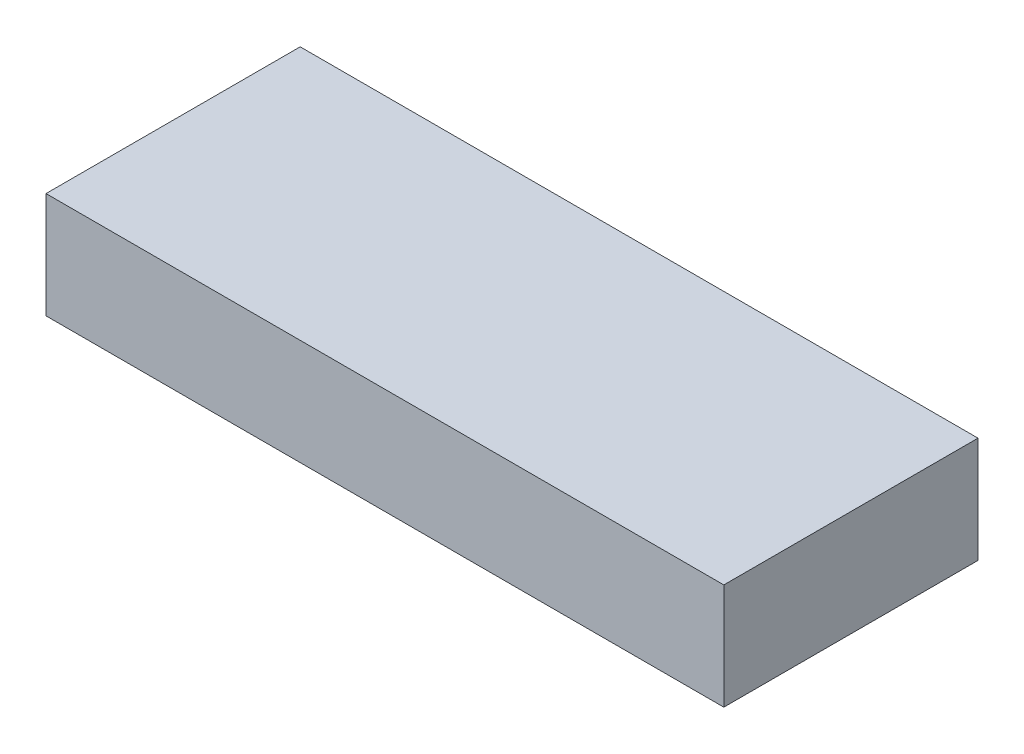
ISO-10303-21;
HEADER;
FILE_DESCRIPTION(('STEP AP214'),'2;1');
FILE_NAME('part.step','',(''),(''),'','','');
FILE_SCHEMA(('AUTOMOTIVE_DESIGN { 1 0 10303 214 1 1 1 1 }'));
ENDSEC;
DATA;
#1=APPLICATION_CONTEXT('core data for automotive mechanical design processes');
#2=APPLICATION_PROTOCOL_DEFINITION('international standard','automotive_design',2000,#1);
#3=PRODUCT_CONTEXT('',#1,'mechanical');
#4=PRODUCT('Part','Part','',(#3));
#5=PRODUCT_RELATED_PRODUCT_CATEGORY('part','',(#4));
#6=PRODUCT_DEFINITION_FORMATION('','',#4);
#7=PRODUCT_DEFINITION_CONTEXT('part definition',#1,'design');
#8=PRODUCT_DEFINITION('design','',#6,#7);
#9=PRODUCT_DEFINITION_SHAPE('','',#8);
#10=(LENGTH_UNIT() NAMED_UNIT(*) SI_UNIT(.MILLI.,.METRE.));
#11=(NAMED_UNIT(*) PLANE_ANGLE_UNIT() SI_UNIT($,.RADIAN.));
#12=(NAMED_UNIT(*) SI_UNIT($,.STERADIAN.) SOLID_ANGLE_UNIT());
#13=UNCERTAINTY_MEASURE_WITH_UNIT(LENGTH_MEASURE(1.E-05),#10,'distance_accuracy_value','');
#14=(GEOMETRIC_REPRESENTATION_CONTEXT(3) GLOBAL_UNCERTAINTY_ASSIGNED_CONTEXT((#13)) GLOBAL_UNIT_ASSIGNED_CONTEXT((#10,
#11,#12)) REPRESENTATION_CONTEXT('',''));
#15=CARTESIAN_POINT('',(0.,0.,0.));
#16=DIRECTION('',(0.,0.,1.));
#17=DIRECTION('',(1.,0.,0.));
#18=AXIS2_PLACEMENT_3D('',#15,#16,#17);
#19=CARTESIAN_POINT('',(0.,-15.,18.));
#20=DIRECTION('',(-1.,0.,0.));
#21=DIRECTION('',(0.,0.,1.));
#22=AXIS2_PLACEMENT_3D('',#19,#20,#21);
#23=PLANE('',#22);
#24=DIRECTION('',(0.,0.,1.));
#25=VECTOR('',#24,1.);
#26=CARTESIAN_POINT('',(0.,0.,18.));
#27=LINE('',#26,#25);
#28=CARTESIAN_POINT('',(0.,0.,-18.));
#29=VERTEX_POINT('',#28);
#30=CARTESIAN_POINT('',(0.,0.,18.));
#31=VERTEX_POINT('',#30);
#32=EDGE_CURVE('E101',#29,#31,#27,.T.);
#33=ORIENTED_EDGE('',*,*,#32,.F.);
#34=DIRECTION('',(0.,1.,0.));
#35=VECTOR('',#34,1.);
#36=CARTESIAN_POINT('',(0.,-15.,-18.));
#37=LINE('',#36,#35);
#38=CARTESIAN_POINT('',(0.,-15.,-18.));
#39=VERTEX_POINT('',#38);
#40=EDGE_CURVE('E11',#39,#29,#37,.T.);
#41=ORIENTED_EDGE('',*,*,#40,.F.);
#42=DIRECTION('',(0.,0.,1.));
#43=VECTOR('',#42,1.);
#44=CARTESIAN_POINT('',(0.,-15.,18.));
#45=LINE('',#44,#43);
#46=CARTESIAN_POINT('',(0.,-15.,18.));
#47=VERTEX_POINT('',#46);
#48=EDGE_CURVE('E95',#39,#47,#45,.T.);
#49=ORIENTED_EDGE('',*,*,#48,.T.);
#50=DIRECTION('',(0.,1.,0.));
#51=VECTOR('',#50,1.);
#52=CARTESIAN_POINT('',(0.,-15.,18.));
#53=LINE('',#52,#51);
#54=EDGE_CURVE('E40',#47,#31,#53,.T.);
#55=ORIENTED_EDGE('',*,*,#54,.T.);
#56=EDGE_LOOP('',(#33,#41,#49,#55));
#57=FACE_BOUND('',#56,.T.);
#58=ADVANCED_FACE('F37',(#57),#23,.T.);
#59=CARTESIAN_POINT('',(0.,-15.,-18.));
#60=DIRECTION('',(0.,0.,-1.));
#61=DIRECTION('',(-1.,0.,0.));
#62=AXIS2_PLACEMENT_3D('',#59,#60,#61);
#63=PLANE('',#62);
#64=DIRECTION('',(-1.,0.,0.));
#65=VECTOR('',#64,1.);
#66=CARTESIAN_POINT('',(0.,0.,-18.));
#67=LINE('',#66,#65);
#68=CARTESIAN_POINT('',(96.,0.,-18.));
#69=VERTEX_POINT('',#68);
#70=EDGE_CURVE('E97',#69,#29,#67,.T.);
#71=ORIENTED_EDGE('',*,*,#70,.F.);
#72=DIRECTION('',(0.,1.,0.));
#73=VECTOR('',#72,1.);
#74=CARTESIAN_POINT('',(96.,-15.,-18.));
#75=LINE('',#74,#73);
#76=CARTESIAN_POINT('',(96.,-15.,-18.));
#77=VERTEX_POINT('',#76);
#78=EDGE_CURVE('E46',#77,#69,#75,.T.);
#79=ORIENTED_EDGE('',*,*,#78,.F.);
#80=DIRECTION('',(-1.,0.,0.));
#81=VECTOR('',#80,1.);
#82=CARTESIAN_POINT('',(0.,-15.,-18.));
#83=LINE('',#82,#81);
#84=EDGE_CURVE('E92',#77,#39,#83,.T.);
#85=ORIENTED_EDGE('',*,*,#84,.T.);
#86=ORIENTED_EDGE('',*,*,#40,.T.);
#87=EDGE_LOOP('',(#71,#79,#85,#86));
#88=FACE_BOUND('',#87,.T.);
#89=ADVANCED_FACE('F111',(#88),#63,.T.);
#90=CARTESIAN_POINT('',(96.,-15.,18.));
#91=DIRECTION('',(1.,0.,0.));
#92=DIRECTION('',(0.,0.,-1.));
#93=AXIS2_PLACEMENT_3D('',#90,#91,#92);
#94=PLANE('',#93);
#95=DIRECTION('',(0.,0.,-1.));
#96=VECTOR('',#95,1.);
#97=CARTESIAN_POINT('',(96.,0.,18.));
#98=LINE('',#97,#96);
#99=CARTESIAN_POINT('',(96.,0.,18.));
#100=VERTEX_POINT('',#99);
#101=EDGE_CURVE('E87',#100,#69,#98,.T.);
#102=ORIENTED_EDGE('',*,*,#101,.F.);
#103=DIRECTION('',(0.,1.,0.));
#104=VECTOR('',#103,1.);
#105=CARTESIAN_POINT('',(96.,-15.,18.));
#106=LINE('',#105,#104);
#107=CARTESIAN_POINT('',(96.,-15.,18.));
#108=VERTEX_POINT('',#107);
#109=EDGE_CURVE('E82',#108,#100,#106,.T.);
#110=ORIENTED_EDGE('',*,*,#109,.F.);
#111=DIRECTION('',(0.,0.,-1.));
#112=VECTOR('',#111,1.);
#113=CARTESIAN_POINT('',(96.,-15.,18.));
#114=LINE('',#113,#112);
#115=EDGE_CURVE('E85',#108,#77,#114,.T.);
#116=ORIENTED_EDGE('',*,*,#115,.T.);
#117=ORIENTED_EDGE('',*,*,#78,.T.);
#118=EDGE_LOOP('',(#102,#110,#116,#117));
#119=FACE_BOUND('',#118,.T.);
#120=ADVANCED_FACE('F84',(#119),#94,.T.);
#121=CARTESIAN_POINT('',(0.,-15.,18.));
#122=DIRECTION('',(0.,0.,1.));
#123=DIRECTION('',(1.,0.,0.));
#124=AXIS2_PLACEMENT_3D('',#121,#122,#123);
#125=PLANE('',#124);
#126=DIRECTION('',(1.,0.,0.));
#127=VECTOR('',#126,1.);
#128=CARTESIAN_POINT('',(0.,0.,18.));
#129=LINE('',#128,#127);
#130=EDGE_CURVE('E104',#31,#100,#129,.T.);
#131=ORIENTED_EDGE('',*,*,#130,.F.);
#132=ORIENTED_EDGE('',*,*,#54,.F.);
#133=DIRECTION('',(1.,0.,0.));
#134=VECTOR('',#133,1.);
#135=CARTESIAN_POINT('',(0.,-15.,18.));
#136=LINE('',#135,#134);
#137=EDGE_CURVE('E91',#47,#108,#136,.T.);
#138=ORIENTED_EDGE('',*,*,#137,.T.);
#139=ORIENTED_EDGE('',*,*,#109,.T.);
#140=EDGE_LOOP('',(#131,#132,#138,#139));
#141=FACE_BOUND('',#140,.T.);
#142=ADVANCED_FACE('F94',(#141),#125,.T.);
#143=CARTESIAN_POINT('',(0.,-15.,0.));
#144=DIRECTION('',(0.,-1.,0.));
#145=DIRECTION('',(0.,0.,-1.));
#146=AXIS2_PLACEMENT_3D('',#143,#144,#145);
#147=PLANE('',#146);
#148=ORIENTED_EDGE('',*,*,#48,.F.);
#149=ORIENTED_EDGE('',*,*,#84,.F.);
#150=ORIENTED_EDGE('',*,*,#115,.F.);
#151=ORIENTED_EDGE('',*,*,#137,.F.);
#152=EDGE_LOOP('',(#148,#149,#150,#151));
#153=FACE_BOUND('',#152,.T.);
#154=ADVANCED_FACE('F90',(#153),#147,.T.);
#155=CARTESIAN_POINT('',(0.,0.,0.));
#156=DIRECTION('',(0.,-1.,0.));
#157=DIRECTION('',(0.,0.,-1.));
#158=AXIS2_PLACEMENT_3D('',#155,#156,#157);
#159=PLANE('',#158);
#160=ORIENTED_EDGE('',*,*,#32,.T.);
#161=ORIENTED_EDGE('',*,*,#130,.T.);
#162=ORIENTED_EDGE('',*,*,#101,.T.);
#163=ORIENTED_EDGE('',*,*,#70,.T.);
#164=EDGE_LOOP('',(#160,#161,#162,#163));
#165=FACE_BOUND('',#164,.T.);
#166=ADVANCED_FACE('F110',(#165),#159,.F.);
#167=CLOSED_SHELL('',(#58,#89,#120,#142,#154,#166));
#168=MANIFOLD_SOLID_BREP('B2',#167);
#169=ADVANCED_BREP_SHAPE_REPRESENTATION('',(#18,#168),#14);
#170=SHAPE_DEFINITION_REPRESENTATION(#9,#169);
ENDSEC;
END-ISO-10303-21;
